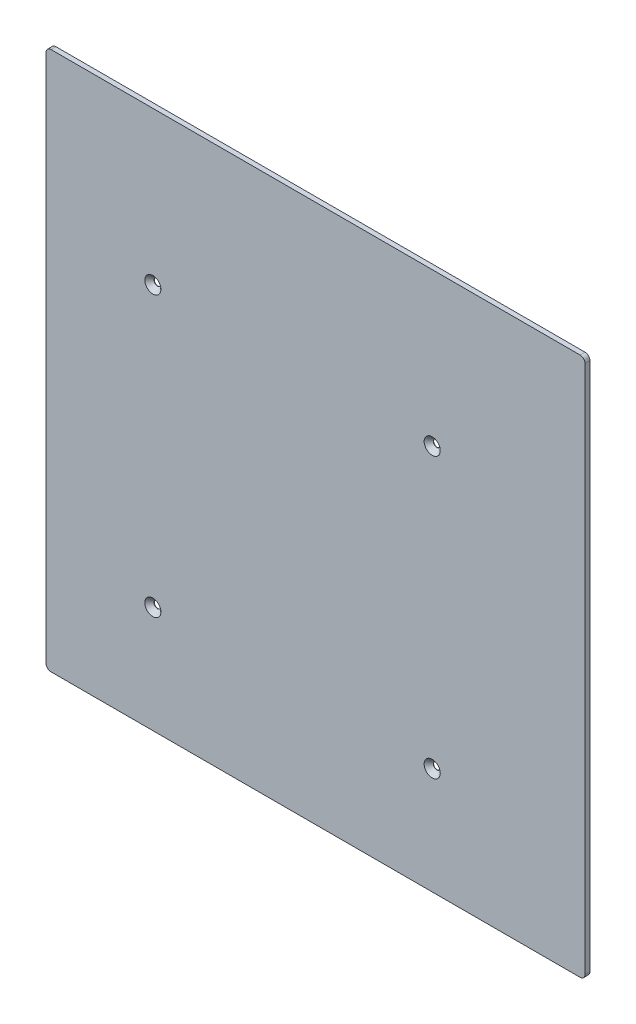
ISO-10303-21;
HEADER;
FILE_DESCRIPTION(('STEP AP214'),'2;1');
FILE_NAME('part.step','',(''),(''),'','','');
FILE_SCHEMA(('AUTOMOTIVE_DESIGN { 1 0 10303 214 1 1 1 1 }'));
ENDSEC;
DATA;
#1=APPLICATION_CONTEXT('core data for automotive mechanical design processes');
#2=APPLICATION_PROTOCOL_DEFINITION('international standard','automotive_design',2000,#1);
#3=PRODUCT_CONTEXT('',#1,'mechanical');
#4=PRODUCT('Part','Part','',(#3));
#5=PRODUCT_RELATED_PRODUCT_CATEGORY('part','',(#4));
#6=PRODUCT_DEFINITION_FORMATION('','',#4);
#7=PRODUCT_DEFINITION_CONTEXT('part definition',#1,'design');
#8=PRODUCT_DEFINITION('design','',#6,#7);
#9=PRODUCT_DEFINITION_SHAPE('','',#8);
#10=(LENGTH_UNIT() NAMED_UNIT(*) SI_UNIT(.MILLI.,.METRE.));
#11=(NAMED_UNIT(*) PLANE_ANGLE_UNIT() SI_UNIT($,.RADIAN.));
#12=(NAMED_UNIT(*) SI_UNIT($,.STERADIAN.) SOLID_ANGLE_UNIT());
#13=UNCERTAINTY_MEASURE_WITH_UNIT(LENGTH_MEASURE(1.E-05),#10,'distance_accuracy_value','');
#14=(GEOMETRIC_REPRESENTATION_CONTEXT(3) GLOBAL_UNCERTAINTY_ASSIGNED_CONTEXT((#13)) GLOBAL_UNIT_ASSIGNED_CONTEXT((#10,
#11,#12)) REPRESENTATION_CONTEXT('',''));
#15=CARTESIAN_POINT('',(0.,0.,0.));
#16=DIRECTION('',(0.,0.,1.));
#17=DIRECTION('',(1.,0.,0.));
#18=AXIS2_PLACEMENT_3D('',#15,#16,#17);
#19=CARTESIAN_POINT('',(0.,0.,0.));
#20=DIRECTION('',(0.,0.,-1.));
#21=DIRECTION('',(-1.,0.,0.));
#22=AXIS2_PLACEMENT_3D('',#19,#20,#21);
#23=PLANE('',#22);
#24=CARTESIAN_POINT('',(-85.,-85.,0.));
#25=DIRECTION('',(0.,0.,1.));
#26=DIRECTION('',(1.,0.,0.));
#27=AXIS2_PLACEMENT_3D('',#24,#25,#26);
#28=CIRCLE('',#27,2.09999999994805);
#29=CARTESIAN_POINT('',(-82.9000000000519,-85.,0.));
#30=VERTEX_POINT('',#29);
#31=EDGE_CURVE('E492',#30,#30,#28,.T.);
#32=ORIENTED_EDGE('',*,*,#31,.T.);
#33=EDGE_LOOP('',(#32));
#34=FACE_BOUND('',#33,.T.);
#35=CARTESIAN_POINT('',(85.,-85.,0.));
#36=DIRECTION('',(0.,0.,1.));
#37=DIRECTION('',(1.,0.,0.));
#38=AXIS2_PLACEMENT_3D('',#35,#36,#37);
#39=CIRCLE('',#38,2.09999999994805);
#40=CARTESIAN_POINT('',(87.0999999999481,-85.,0.));
#41=VERTEX_POINT('',#40);
#42=EDGE_CURVE('E485',#41,#41,#39,.T.);
#43=ORIENTED_EDGE('',*,*,#42,.T.);
#44=EDGE_LOOP('',(#43));
#45=FACE_BOUND('',#44,.T.);
#46=CARTESIAN_POINT('',(85.,85.,0.));
#47=DIRECTION('',(0.,0.,1.));
#48=DIRECTION('',(1.,0.,0.));
#49=AXIS2_PLACEMENT_3D('',#46,#47,#48);
#50=CIRCLE('',#49,2.09999999994805);
#51=CARTESIAN_POINT('',(87.0999999999481,85.,0.));
#52=VERTEX_POINT('',#51);
#53=EDGE_CURVE('E475',#52,#52,#50,.T.);
#54=ORIENTED_EDGE('',*,*,#53,.T.);
#55=EDGE_LOOP('',(#54));
#56=FACE_BOUND('',#55,.T.);
#57=DIRECTION('',(-1.,0.,0.));
#58=VECTOR('',#57,1.);
#59=CARTESIAN_POINT('',(178.,-150.,0.));
#60=LINE('',#59,#58);
#61=CARTESIAN_POINT('',(175.,-150.,0.));
#62=VERTEX_POINT('',#61);
#63=CARTESIAN_POINT('',(-147.,-150.,0.));
#64=VERTEX_POINT('',#63);
#65=EDGE_CURVE('E164',#62,#64,#60,.T.);
#66=ORIENTED_EDGE('',*,*,#65,.T.);
#67=CARTESIAN_POINT('',(-147.,-147.,0.));
#68=DIRECTION('',(0.,0.,-1.));
#69=DIRECTION('',(-1.,0.,0.));
#70=AXIS2_PLACEMENT_3D('',#67,#68,#69);
#71=CIRCLE('',#70,3.);
#72=CARTESIAN_POINT('',(-150.,-147.,0.));
#73=VERTEX_POINT('',#72);
#74=EDGE_CURVE('E201',#64,#73,#71,.T.);
#75=ORIENTED_EDGE('',*,*,#74,.T.);
#76=DIRECTION('',(0.,1.,0.));
#77=VECTOR('',#76,1.);
#78=CARTESIAN_POINT('',(-150.,-150.,0.));
#79=LINE('',#78,#77);
#80=CARTESIAN_POINT('',(-150.,175.,0.));
#81=VERTEX_POINT('',#80);
#82=EDGE_CURVE('E183',#73,#81,#79,.T.);
#83=ORIENTED_EDGE('',*,*,#82,.T.);
#84=CARTESIAN_POINT('',(-147.,175.,0.));
#85=DIRECTION('',(0.,0.,-1.));
#86=DIRECTION('',(-1.,0.,0.));
#87=AXIS2_PLACEMENT_3D('',#84,#85,#86);
#88=CIRCLE('',#87,3.);
#89=CARTESIAN_POINT('',(-147.,178.,0.));
#90=VERTEX_POINT('',#89);
#91=EDGE_CURVE('E197',#81,#90,#88,.T.);
#92=ORIENTED_EDGE('',*,*,#91,.T.);
#93=DIRECTION('',(1.,0.,0.));
#94=VECTOR('',#93,1.);
#95=CARTESIAN_POINT('',(-150.,178.,0.));
#96=LINE('',#95,#94);
#97=CARTESIAN_POINT('',(175.,178.,0.));
#98=VERTEX_POINT('',#97);
#99=EDGE_CURVE('E186',#90,#98,#96,.T.);
#100=ORIENTED_EDGE('',*,*,#99,.T.);
#101=CARTESIAN_POINT('',(175.,175.,0.));
#102=DIRECTION('',(0.,0.,-1.));
#103=DIRECTION('',(-1.,0.,0.));
#104=AXIS2_PLACEMENT_3D('',#101,#102,#103);
#105=CIRCLE('',#104,3.);
#106=CARTESIAN_POINT('',(178.,175.,0.));
#107=VERTEX_POINT('',#106);
#108=EDGE_CURVE('E195',#98,#107,#105,.T.);
#109=ORIENTED_EDGE('',*,*,#108,.T.);
#110=DIRECTION('',(0.,-1.,0.));
#111=VECTOR('',#110,1.);
#112=CARTESIAN_POINT('',(178.,178.,0.));
#113=LINE('',#112,#111);
#114=CARTESIAN_POINT('',(178.,-147.,0.));
#115=VERTEX_POINT('',#114);
#116=EDGE_CURVE('E172',#107,#115,#113,.T.);
#117=ORIENTED_EDGE('',*,*,#116,.T.);
#118=CARTESIAN_POINT('',(175.,-147.,0.));
#119=DIRECTION('',(0.,0.,-1.));
#120=DIRECTION('',(-1.,0.,0.));
#121=AXIS2_PLACEMENT_3D('',#118,#119,#120);
#122=CIRCLE('',#121,3.);
#123=EDGE_CURVE('E199',#115,#62,#122,.T.);
#124=ORIENTED_EDGE('',*,*,#123,.T.);
#125=EDGE_LOOP('',(#66,#75,#83,#92,#100,#109,#117,#124));
#126=FACE_BOUND('',#125,.T.);
#127=DIRECTION('',(1.,0.,0.));
#128=VECTOR('',#127,1.);
#129=CARTESIAN_POINT('',(-101.46292574176,117.5,0.));
#130=LINE('',#129,#128);
#131=CARTESIAN_POINT('',(-101.46292574176,117.5,0.));
#132=VERTEX_POINT('',#131);
#133=CARTESIAN_POINT('',(-72.6507614869108,117.5,0.));
#134=VERTEX_POINT('',#133);
#135=EDGE_CURVE('E129',#132,#134,#130,.T.);
#136=ORIENTED_EDGE('',*,*,#135,.F.);
#137=DIRECTION('',(0.,1.,0.));
#138=VECTOR('',#137,1.);
#139=CARTESIAN_POINT('',(-101.46292574176,106.050790199477,0.));
#140=LINE('',#139,#138);
#141=CARTESIAN_POINT('',(-101.46292574176,106.050790199477,0.));
#142=VERTEX_POINT('',#141);
#143=EDGE_CURVE('E146',#142,#132,#140,.T.);
#144=ORIENTED_EDGE('',*,*,#143,.F.);
#145=DIRECTION('',(-1.,0.,0.));
#146=VECTOR('',#145,1.);
#147=CARTESIAN_POINT('',(-72.6507614869108,106.050790199477,0.));
#148=LINE('',#147,#146);
#149=CARTESIAN_POINT('',(-72.6507614869108,106.050790199477,0.));
#150=VERTEX_POINT('',#149);
#151=EDGE_CURVE('E149',#150,#142,#148,.T.);
#152=ORIENTED_EDGE('',*,*,#151,.F.);
#153=DIRECTION('',(0.,-1.,0.));
#154=VECTOR('',#153,1.);
#155=CARTESIAN_POINT('',(-72.6507614869108,117.5,0.));
#156=LINE('',#155,#154);
#157=EDGE_CURVE('E158',#134,#150,#156,.T.);
#158=ORIENTED_EDGE('',*,*,#157,.F.);
#159=EDGE_LOOP('',(#136,#144,#152,#158));
#160=FACE_BOUND('',#159,.T.);
#161=CARTESIAN_POINT('',(-85.,85.,0.));
#162=DIRECTION('',(0.,0.,1.));
#163=DIRECTION('',(1.,0.,0.));
#164=AXIS2_PLACEMENT_3D('',#161,#162,#163);
#165=CIRCLE('',#164,2.09999999994805);
#166=CARTESIAN_POINT('',(-82.9000000000519,85.,0.));
#167=VERTEX_POINT('',#166);
#168=EDGE_CURVE('E152',#167,#167,#165,.T.);
#169=ORIENTED_EDGE('',*,*,#168,.T.);
#170=EDGE_LOOP('',(#169));
#171=FACE_BOUND('',#170,.T.);
#172=ADVANCED_FACE('F33',(#34,#45,#56,#126,#160,#171),#23,.T.);
#173=CARTESIAN_POINT('',(178.,-150.,3.));
#174=DIRECTION('',(0.,-1.,0.));
#175=DIRECTION('',(0.,0.,-1.));
#176=AXIS2_PLACEMENT_3D('',#173,#174,#175);
#177=PLANE('',#176);
#178=DIRECTION('',(-1.,0.,0.));
#179=VECTOR('',#178,1.);
#180=CARTESIAN_POINT('',(178.,-150.,3.));
#181=LINE('',#180,#179);
#182=CARTESIAN_POINT('',(175.,-150.,3.));
#183=VERTEX_POINT('',#182);
#184=CARTESIAN_POINT('',(-147.,-150.,3.));
#185=VERTEX_POINT('',#184);
#186=EDGE_CURVE('E168',#183,#185,#181,.T.);
#187=ORIENTED_EDGE('',*,*,#186,.T.);
#188=DIRECTION('',(0.,0.,-1.));
#189=VECTOR('',#188,1.);
#190=CARTESIAN_POINT('',(-147.,-150.,3.));
#191=LINE('',#190,#189);
#192=EDGE_CURVE('E192',#185,#64,#191,.T.);
#193=ORIENTED_EDGE('',*,*,#192,.T.);
#194=ORIENTED_EDGE('',*,*,#65,.F.);
#195=DIRECTION('',(0.,0.,-1.));
#196=VECTOR('',#195,1.);
#197=CARTESIAN_POINT('',(175.,-150.,3.));
#198=LINE('',#197,#196);
#199=EDGE_CURVE('E180',#62,#183,#198,.F.);
#200=ORIENTED_EDGE('',*,*,#199,.T.);
#201=EDGE_LOOP('',(#187,#193,#194,#200));
#202=FACE_BOUND('',#201,.T.);
#203=ADVANCED_FACE('F243',(#202),#177,.T.);
#204=CARTESIAN_POINT('',(178.,178.,3.));
#205=DIRECTION('',(1.,0.,0.));
#206=DIRECTION('',(0.,0.,-1.));
#207=AXIS2_PLACEMENT_3D('',#204,#205,#206);
#208=PLANE('',#207);
#209=DIRECTION('',(0.,-1.,0.));
#210=VECTOR('',#209,1.);
#211=CARTESIAN_POINT('',(178.,178.,3.));
#212=LINE('',#211,#210);
#213=CARTESIAN_POINT('',(178.,175.,3.));
#214=VERTEX_POINT('',#213);
#215=CARTESIAN_POINT('',(178.,-147.,3.));
#216=VERTEX_POINT('',#215);
#217=EDGE_CURVE('E177',#214,#216,#212,.T.);
#218=ORIENTED_EDGE('',*,*,#217,.T.);
#219=DIRECTION('',(0.,0.,-1.));
#220=VECTOR('',#219,1.);
#221=CARTESIAN_POINT('',(178.,-147.,3.));
#222=LINE('',#221,#220);
#223=EDGE_CURVE('E217',#216,#115,#222,.T.);
#224=ORIENTED_EDGE('',*,*,#223,.T.);
#225=ORIENTED_EDGE('',*,*,#116,.F.);
#226=DIRECTION('',(0.,0.,-1.));
#227=VECTOR('',#226,1.);
#228=CARTESIAN_POINT('',(178.,175.,3.));
#229=LINE('',#228,#227);
#230=EDGE_CURVE('E215',#107,#214,#229,.F.);
#231=ORIENTED_EDGE('',*,*,#230,.T.);
#232=EDGE_LOOP('',(#218,#224,#225,#231));
#233=FACE_BOUND('',#232,.T.);
#234=ADVANCED_FACE('F250',(#233),#208,.T.);
#235=CARTESIAN_POINT('',(-150.,178.,3.));
#236=DIRECTION('',(0.,1.,0.));
#237=DIRECTION('',(-1.,0.,0.));
#238=AXIS2_PLACEMENT_3D('',#235,#236,#237);
#239=PLANE('',#238);
#240=ORIENTED_EDGE('',*,*,#99,.F.);
#241=DIRECTION('',(0.,0.,-1.));
#242=VECTOR('',#241,1.);
#243=CARTESIAN_POINT('',(-147.,178.,3.));
#244=LINE('',#243,#242);
#245=CARTESIAN_POINT('',(-147.,178.,3.));
#246=VERTEX_POINT('',#245);
#247=EDGE_CURVE('E11',#90,#246,#244,.F.);
#248=ORIENTED_EDGE('',*,*,#247,.T.);
#249=DIRECTION('',(1.,0.,0.));
#250=VECTOR('',#249,1.);
#251=CARTESIAN_POINT('',(-150.,178.,3.));
#252=LINE('',#251,#250);
#253=CARTESIAN_POINT('',(175.,178.,3.));
#254=VERTEX_POINT('',#253);
#255=EDGE_CURVE('E175',#246,#254,#252,.T.);
#256=ORIENTED_EDGE('',*,*,#255,.T.);
#257=DIRECTION('',(0.,0.,-1.));
#258=VECTOR('',#257,1.);
#259=CARTESIAN_POINT('',(175.,178.,3.));
#260=LINE('',#259,#258);
#261=EDGE_CURVE('E41',#254,#98,#260,.T.);
#262=ORIENTED_EDGE('',*,*,#261,.T.);
#263=EDGE_LOOP('',(#240,#248,#256,#262));
#264=FACE_BOUND('',#263,.T.);
#265=ADVANCED_FACE('F221',(#264),#239,.T.);
#266=CARTESIAN_POINT('',(-150.,-150.,3.));
#267=DIRECTION('',(-1.,0.,0.));
#268=DIRECTION('',(0.,0.,1.));
#269=AXIS2_PLACEMENT_3D('',#266,#267,#268);
#270=PLANE('',#269);
#271=ORIENTED_EDGE('',*,*,#82,.F.);
#272=DIRECTION('',(0.,0.,-1.));
#273=VECTOR('',#272,1.);
#274=CARTESIAN_POINT('',(-150.,-147.,3.));
#275=LINE('',#274,#273);
#276=CARTESIAN_POINT('',(-150.,-147.,3.));
#277=VERTEX_POINT('',#276);
#278=EDGE_CURVE('E206',#73,#277,#275,.F.);
#279=ORIENTED_EDGE('',*,*,#278,.T.);
#280=DIRECTION('',(0.,1.,0.));
#281=VECTOR('',#280,1.);
#282=CARTESIAN_POINT('',(-150.,-150.,3.));
#283=LINE('',#282,#281);
#284=CARTESIAN_POINT('',(-150.,175.,3.));
#285=VERTEX_POINT('',#284);
#286=EDGE_CURVE('E171',#277,#285,#283,.T.);
#287=ORIENTED_EDGE('',*,*,#286,.T.);
#288=DIRECTION('',(0.,0.,-1.));
#289=VECTOR('',#288,1.);
#290=CARTESIAN_POINT('',(-150.,175.,3.));
#291=LINE('',#290,#289);
#292=EDGE_CURVE('E203',#285,#81,#291,.T.);
#293=ORIENTED_EDGE('',*,*,#292,.T.);
#294=EDGE_LOOP('',(#271,#279,#287,#293));
#295=FACE_BOUND('',#294,.T.);
#296=ADVANCED_FACE('F232',(#295),#270,.T.);
#297=CARTESIAN_POINT('',(0.,0.,3.));
#298=DIRECTION('',(0.,0.,-1.));
#299=DIRECTION('',(-1.,0.,0.));
#300=AXIS2_PLACEMENT_3D('',#297,#298,#299);
#301=PLANE('',#300);
#302=CARTESIAN_POINT('',(-85.,-85.,3.));
#303=DIRECTION('',(0.,0.,1.));
#304=DIRECTION('',(1.,0.,0.));
#305=AXIS2_PLACEMENT_3D('',#302,#303,#304);
#306=CIRCLE('',#305,4.90000000002055);
#307=CARTESIAN_POINT('',(-80.0999999999794,-85.,3.));
#308=VERTEX_POINT('',#307);
#309=EDGE_CURVE('E461',#308,#308,#306,.T.);
#310=ORIENTED_EDGE('',*,*,#309,.F.);
#311=EDGE_LOOP('',(#310));
#312=FACE_BOUND('',#311,.T.);
#313=CARTESIAN_POINT('',(85.,-85.,3.));
#314=DIRECTION('',(0.,0.,1.));
#315=DIRECTION('',(1.,0.,0.));
#316=AXIS2_PLACEMENT_3D('',#313,#314,#315);
#317=CIRCLE('',#316,4.90000000002055);
#318=CARTESIAN_POINT('',(89.9000000000206,-85.,3.));
#319=VERTEX_POINT('',#318);
#320=EDGE_CURVE('E465',#319,#319,#317,.T.);
#321=ORIENTED_EDGE('',*,*,#320,.F.);
#322=EDGE_LOOP('',(#321));
#323=FACE_BOUND('',#322,.T.);
#324=CARTESIAN_POINT('',(85.,85.,3.));
#325=DIRECTION('',(0.,0.,1.));
#326=DIRECTION('',(1.,0.,0.));
#327=AXIS2_PLACEMENT_3D('',#324,#325,#326);
#328=CIRCLE('',#327,4.90000000002055);
#329=CARTESIAN_POINT('',(89.9000000000206,85.,3.));
#330=VERTEX_POINT('',#329);
#331=EDGE_CURVE('E469',#330,#330,#328,.T.);
#332=ORIENTED_EDGE('',*,*,#331,.F.);
#333=EDGE_LOOP('',(#332));
#334=FACE_BOUND('',#333,.T.);
#335=CARTESIAN_POINT('',(-85.,85.,3.));
#336=DIRECTION('',(0.,0.,1.));
#337=DIRECTION('',(1.,0.,0.));
#338=AXIS2_PLACEMENT_3D('',#335,#336,#337);
#339=CIRCLE('',#338,4.90000000002055);
#340=CARTESIAN_POINT('',(-80.0999999999794,85.,3.));
#341=VERTEX_POINT('',#340);
#342=EDGE_CURVE('E472',#341,#341,#339,.T.);
#343=ORIENTED_EDGE('',*,*,#342,.F.);
#344=EDGE_LOOP('',(#343));
#345=FACE_BOUND('',#344,.T.);
#346=ORIENTED_EDGE('',*,*,#286,.F.);
#347=CARTESIAN_POINT('',(-147.,-147.,3.));
#348=DIRECTION('',(0.,0.,-1.));
#349=DIRECTION('',(-1.,0.,0.));
#350=AXIS2_PLACEMENT_3D('',#347,#348,#349);
#351=CIRCLE('',#350,3.);
#352=EDGE_CURVE('E213',#277,#185,#351,.F.);
#353=ORIENTED_EDGE('',*,*,#352,.T.);
#354=ORIENTED_EDGE('',*,*,#186,.F.);
#355=CARTESIAN_POINT('',(175.,-147.,3.));
#356=DIRECTION('',(0.,0.,-1.));
#357=DIRECTION('',(-1.,0.,0.));
#358=AXIS2_PLACEMENT_3D('',#355,#356,#357);
#359=CIRCLE('',#358,3.);
#360=EDGE_CURVE('E211',#183,#216,#359,.F.);
#361=ORIENTED_EDGE('',*,*,#360,.T.);
#362=ORIENTED_EDGE('',*,*,#217,.F.);
#363=CARTESIAN_POINT('',(175.,175.,3.));
#364=DIRECTION('',(0.,0.,-1.));
#365=DIRECTION('',(-1.,0.,0.));
#366=AXIS2_PLACEMENT_3D('',#363,#364,#365);
#367=CIRCLE('',#366,3.);
#368=EDGE_CURVE('E48',#214,#254,#367,.F.);
#369=ORIENTED_EDGE('',*,*,#368,.T.);
#370=ORIENTED_EDGE('',*,*,#255,.F.);
#371=CARTESIAN_POINT('',(-147.,175.,3.));
#372=DIRECTION('',(0.,0.,-1.));
#373=DIRECTION('',(-1.,0.,0.));
#374=AXIS2_PLACEMENT_3D('',#371,#372,#373);
#375=CIRCLE('',#374,3.);
#376=EDGE_CURVE('E209',#246,#285,#375,.F.);
#377=ORIENTED_EDGE('',*,*,#376,.T.);
#378=EDGE_LOOP('',(#346,#353,#354,#361,#362,#369,#370,#377));
#379=FACE_BOUND('',#378,.T.);
#380=ADVANCED_FACE('F236',(#312,#323,#334,#345,#379),#301,.F.);
#381=CARTESIAN_POINT('',(-101.46292574176,117.5,0.5));
#382=DIRECTION('',(0.,1.,0.));
#383=DIRECTION('',(0.,0.,1.));
#384=AXIS2_PLACEMENT_3D('',#381,#382,#383);
#385=PLANE('',#384);
#386=ORIENTED_EDGE('',*,*,#135,.T.);
#387=DIRECTION('',(0.,0.,-1.));
#388=VECTOR('',#387,1.);
#389=CARTESIAN_POINT('',(-72.6507614869108,117.5,0.5));
#390=LINE('',#389,#388);
#391=CARTESIAN_POINT('',(-72.6507614869108,117.5,0.5));
#392=VERTEX_POINT('',#391);
#393=EDGE_CURVE('E122',#392,#134,#390,.T.);
#394=ORIENTED_EDGE('',*,*,#393,.F.);
#395=DIRECTION('',(1.,0.,0.));
#396=VECTOR('',#395,1.);
#397=CARTESIAN_POINT('',(-101.46292574176,117.5,0.5));
#398=LINE('',#397,#396);
#399=CARTESIAN_POINT('',(-101.46292574176,117.5,0.5));
#400=VERTEX_POINT('',#399);
#401=EDGE_CURVE('E126',#400,#392,#398,.T.);
#402=ORIENTED_EDGE('',*,*,#401,.F.);
#403=DIRECTION('',(0.,0.,-1.));
#404=VECTOR('',#403,1.);
#405=CARTESIAN_POINT('',(-101.46292574176,117.5,0.5));
#406=LINE('',#405,#404);
#407=EDGE_CURVE('E162',#400,#132,#406,.T.);
#408=ORIENTED_EDGE('',*,*,#407,.T.);
#409=EDGE_LOOP('',(#386,#394,#402,#408));
#410=FACE_BOUND('',#409,.T.);
#411=ADVANCED_FACE('F124',(#410),#385,.F.);
#412=CARTESIAN_POINT('',(-101.46292574176,106.050790199477,0.5));
#413=DIRECTION('',(-1.,0.,0.));
#414=DIRECTION('',(0.,0.,1.));
#415=AXIS2_PLACEMENT_3D('',#412,#413,#414);
#416=PLANE('',#415);
#417=ORIENTED_EDGE('',*,*,#143,.T.);
#418=ORIENTED_EDGE('',*,*,#407,.F.);
#419=DIRECTION('',(0.,1.,0.));
#420=VECTOR('',#419,1.);
#421=CARTESIAN_POINT('',(-101.46292574176,106.050790199477,0.5));
#422=LINE('',#421,#420);
#423=CARTESIAN_POINT('',(-101.46292574176,106.050790199477,0.5));
#424=VERTEX_POINT('',#423);
#425=EDGE_CURVE('E134',#424,#400,#422,.T.);
#426=ORIENTED_EDGE('',*,*,#425,.F.);
#427=DIRECTION('',(0.,0.,-1.));
#428=VECTOR('',#427,1.);
#429=CARTESIAN_POINT('',(-101.46292574176,106.050790199477,0.5));
#430=LINE('',#429,#428);
#431=EDGE_CURVE('E165',#424,#142,#430,.T.);
#432=ORIENTED_EDGE('',*,*,#431,.T.);
#433=EDGE_LOOP('',(#417,#418,#426,#432));
#434=FACE_BOUND('',#433,.T.);
#435=ADVANCED_FACE('F398',(#434),#416,.F.);
#436=CARTESIAN_POINT('',(-72.6507614869108,106.050790199477,0.5));
#437=DIRECTION('',(0.,-1.,0.));
#438=DIRECTION('',(0.,0.,-1.));
#439=AXIS2_PLACEMENT_3D('',#436,#437,#438);
#440=PLANE('',#439);
#441=ORIENTED_EDGE('',*,*,#151,.T.);
#442=ORIENTED_EDGE('',*,*,#431,.F.);
#443=DIRECTION('',(-1.,0.,0.));
#444=VECTOR('',#443,1.);
#445=CARTESIAN_POINT('',(-72.6507614869108,106.050790199477,0.5));
#446=LINE('',#445,#444);
#447=CARTESIAN_POINT('',(-72.6507614869108,106.050790199477,0.5));
#448=VERTEX_POINT('',#447);
#449=EDGE_CURVE('E142',#448,#424,#446,.T.);
#450=ORIENTED_EDGE('',*,*,#449,.F.);
#451=DIRECTION('',(0.,0.,-1.));
#452=VECTOR('',#451,1.);
#453=CARTESIAN_POINT('',(-72.6507614869108,106.050790199477,0.5));
#454=LINE('',#453,#452);
#455=EDGE_CURVE('E133',#448,#150,#454,.T.);
#456=ORIENTED_EDGE('',*,*,#455,.T.);
#457=EDGE_LOOP('',(#441,#442,#450,#456));
#458=FACE_BOUND('',#457,.T.);
#459=ADVANCED_FACE('F390',(#458),#440,.F.);
#460=CARTESIAN_POINT('',(-72.6507614869108,117.5,0.5));
#461=DIRECTION('',(1.,0.,0.));
#462=DIRECTION('',(0.,0.,-1.));
#463=AXIS2_PLACEMENT_3D('',#460,#461,#462);
#464=PLANE('',#463);
#465=ORIENTED_EDGE('',*,*,#157,.T.);
#466=ORIENTED_EDGE('',*,*,#455,.F.);
#467=DIRECTION('',(0.,-1.,0.));
#468=VECTOR('',#467,1.);
#469=CARTESIAN_POINT('',(-72.6507614869108,117.5,0.5));
#470=LINE('',#469,#468);
#471=EDGE_CURVE('E137',#392,#448,#470,.T.);
#472=ORIENTED_EDGE('',*,*,#471,.F.);
#473=ORIENTED_EDGE('',*,*,#393,.T.);
#474=EDGE_LOOP('',(#465,#466,#472,#473));
#475=FACE_BOUND('',#474,.T.);
#476=ADVANCED_FACE('F138',(#475),#464,.F.);
#477=CARTESIAN_POINT('',(0.,0.,0.5));
#478=DIRECTION('',(0.,0.,-1.));
#479=DIRECTION('',(-1.,0.,0.));
#480=AXIS2_PLACEMENT_3D('',#477,#478,#479);
#481=PLANE('',#480);
#482=ORIENTED_EDGE('',*,*,#401,.T.);
#483=ORIENTED_EDGE('',*,*,#471,.T.);
#484=ORIENTED_EDGE('',*,*,#449,.T.);
#485=ORIENTED_EDGE('',*,*,#425,.T.);
#486=EDGE_LOOP('',(#482,#483,#484,#485));
#487=FACE_BOUND('',#486,.T.);
#488=ADVANCED_FACE('F144',(#487),#481,.T.);
#489=CARTESIAN_POINT('',(-85.,85.,3.));
#490=DIRECTION('',(0.,0.,1.));
#491=DIRECTION('',(1.,0.,0.));
#492=AXIS2_PLACEMENT_3D('',#489,#490,#491);
#493=CYLINDRICAL_SURFACE('',#492,2.09999999994805);
#494=ORIENTED_EDGE('',*,*,#168,.F.);
#495=EDGE_LOOP('',(#494));
#496=FACE_BOUND('',#495,.T.);
#497=CARTESIAN_POINT('',(-85.,85.,0.199999999984335));
#498=DIRECTION('',(0.,0.,1.));
#499=DIRECTION('',(1.,0.,0.));
#500=AXIS2_PLACEMENT_3D('',#497,#498,#499);
#501=CIRCLE('',#500,2.09999999994805);
#502=CARTESIAN_POINT('',(-82.9000000000519,85.,0.199999999984335));
#503=VERTEX_POINT('',#502);
#504=EDGE_CURVE('E474',#503,#503,#501,.T.);
#505=ORIENTED_EDGE('',*,*,#504,.T.);
#506=EDGE_LOOP('',(#505));
#507=FACE_BOUND('',#506,.T.);
#508=ADVANCED_FACE('F361',(#496,#507),#493,.F.);
#509=CARTESIAN_POINT('',(-85.,85.,3.));
#510=DIRECTION('',(0.,0.,1.));
#511=DIRECTION('',(1.,0.,0.));
#512=AXIS2_PLACEMENT_3D('',#509,#510,#511);
#513=CONICAL_SURFACE('',#512,4.90000000002055,0.785398163407599);
#514=ORIENTED_EDGE('',*,*,#504,.F.);
#515=EDGE_LOOP('',(#514));
#516=FACE_BOUND('',#515,.T.);
#517=ORIENTED_EDGE('',*,*,#342,.T.);
#518=EDGE_LOOP('',(#517));
#519=FACE_BOUND('',#518,.T.);
#520=ADVANCED_FACE('F352',(#516,#519),#513,.F.);
#521=CARTESIAN_POINT('',(85.,85.,3.));
#522=DIRECTION('',(0.,0.,1.));
#523=DIRECTION('',(1.,0.,0.));
#524=AXIS2_PLACEMENT_3D('',#521,#522,#523);
#525=CYLINDRICAL_SURFACE('',#524,2.09999999994805);
#526=ORIENTED_EDGE('',*,*,#53,.F.);
#527=EDGE_LOOP('',(#526));
#528=FACE_BOUND('',#527,.T.);
#529=CARTESIAN_POINT('',(85.,85.,0.199999999984335));
#530=DIRECTION('',(0.,0.,1.));
#531=DIRECTION('',(1.,0.,0.));
#532=AXIS2_PLACEMENT_3D('',#529,#530,#531);
#533=CIRCLE('',#532,2.09999999994805);
#534=CARTESIAN_POINT('',(87.0999999999481,85.,0.199999999984335));
#535=VERTEX_POINT('',#534);
#536=EDGE_CURVE('E479',#535,#535,#533,.T.);
#537=ORIENTED_EDGE('',*,*,#536,.T.);
#538=EDGE_LOOP('',(#537));
#539=FACE_BOUND('',#538,.T.);
#540=ADVANCED_FACE('F343',(#528,#539),#525,.F.);
#541=CARTESIAN_POINT('',(85.,85.,3.));
#542=DIRECTION('',(0.,0.,1.));
#543=DIRECTION('',(1.,0.,0.));
#544=AXIS2_PLACEMENT_3D('',#541,#542,#543);
#545=CONICAL_SURFACE('',#544,4.90000000002055,0.785398163407599);
#546=ORIENTED_EDGE('',*,*,#536,.F.);
#547=EDGE_LOOP('',(#546));
#548=FACE_BOUND('',#547,.T.);
#549=ORIENTED_EDGE('',*,*,#331,.T.);
#550=EDGE_LOOP('',(#549));
#551=FACE_BOUND('',#550,.T.);
#552=ADVANCED_FACE('F334',(#548,#551),#545,.F.);
#553=CARTESIAN_POINT('',(85.,-85.,3.));
#554=DIRECTION('',(0.,0.,1.));
#555=DIRECTION('',(1.,0.,0.));
#556=AXIS2_PLACEMENT_3D('',#553,#554,#555);
#557=CYLINDRICAL_SURFACE('',#556,2.09999999994805);
#558=ORIENTED_EDGE('',*,*,#42,.F.);
#559=EDGE_LOOP('',(#558));
#560=FACE_BOUND('',#559,.T.);
#561=CARTESIAN_POINT('',(85.,-85.,0.199999999984335));
#562=DIRECTION('',(0.,0.,1.));
#563=DIRECTION('',(1.,0.,0.));
#564=AXIS2_PLACEMENT_3D('',#561,#562,#563);
#565=CIRCLE('',#564,2.09999999994805);
#566=CARTESIAN_POINT('',(87.0999999999481,-85.,0.199999999984335));
#567=VERTEX_POINT('',#566);
#568=EDGE_CURVE('E488',#567,#567,#565,.T.);
#569=ORIENTED_EDGE('',*,*,#568,.T.);
#570=EDGE_LOOP('',(#569));
#571=FACE_BOUND('',#570,.T.);
#572=ADVANCED_FACE('F325',(#560,#571),#557,.F.);
#573=CARTESIAN_POINT('',(85.,-85.,3.));
#574=DIRECTION('',(0.,0.,1.));
#575=DIRECTION('',(1.,0.,0.));
#576=AXIS2_PLACEMENT_3D('',#573,#574,#575);
#577=CONICAL_SURFACE('',#576,4.90000000002055,0.785398163407599);
#578=ORIENTED_EDGE('',*,*,#568,.F.);
#579=EDGE_LOOP('',(#578));
#580=FACE_BOUND('',#579,.T.);
#581=ORIENTED_EDGE('',*,*,#320,.T.);
#582=EDGE_LOOP('',(#581));
#583=FACE_BOUND('',#582,.T.);
#584=ADVANCED_FACE('F316',(#580,#583),#577,.F.);
#585=CARTESIAN_POINT('',(-85.,-85.,3.));
#586=DIRECTION('',(0.,0.,1.));
#587=DIRECTION('',(1.,0.,0.));
#588=AXIS2_PLACEMENT_3D('',#585,#586,#587);
#589=CYLINDRICAL_SURFACE('',#588,2.09999999994805);
#590=ORIENTED_EDGE('',*,*,#31,.F.);
#591=EDGE_LOOP('',(#590));
#592=FACE_BOUND('',#591,.T.);
#593=CARTESIAN_POINT('',(-85.,-85.,0.199999999984335));
#594=DIRECTION('',(0.,0.,1.));
#595=DIRECTION('',(1.,0.,0.));
#596=AXIS2_PLACEMENT_3D('',#593,#594,#595);
#597=CIRCLE('',#596,2.09999999994805);
#598=CARTESIAN_POINT('',(-82.9000000000519,-85.,0.199999999984335));
#599=VERTEX_POINT('',#598);
#600=EDGE_CURVE('E494',#599,#599,#597,.T.);
#601=ORIENTED_EDGE('',*,*,#600,.T.);
#602=EDGE_LOOP('',(#601));
#603=FACE_BOUND('',#602,.T.);
#604=ADVANCED_FACE('F307',(#592,#603),#589,.F.);
#605=CARTESIAN_POINT('',(-85.,-85.,3.));
#606=DIRECTION('',(0.,0.,1.));
#607=DIRECTION('',(1.,0.,0.));
#608=AXIS2_PLACEMENT_3D('',#605,#606,#607);
#609=CONICAL_SURFACE('',#608,4.90000000002055,0.785398163407599);
#610=ORIENTED_EDGE('',*,*,#600,.F.);
#611=EDGE_LOOP('',(#610));
#612=FACE_BOUND('',#611,.T.);
#613=ORIENTED_EDGE('',*,*,#309,.T.);
#614=EDGE_LOOP('',(#613));
#615=FACE_BOUND('',#614,.T.);
#616=ADVANCED_FACE('F276',(#612,#615),#609,.F.);
#617=CARTESIAN_POINT('',(-147.,-147.,3.));
#618=DIRECTION('',(0.,0.,-1.));
#619=DIRECTION('',(-1.,0.,0.));
#620=AXIS2_PLACEMENT_3D('',#617,#618,#619);
#621=CYLINDRICAL_SURFACE('',#620,3.);
#622=ORIENTED_EDGE('',*,*,#352,.F.);
#623=ORIENTED_EDGE('',*,*,#278,.F.);
#624=ORIENTED_EDGE('',*,*,#74,.F.);
#625=ORIENTED_EDGE('',*,*,#192,.F.);
#626=EDGE_LOOP('',(#622,#623,#624,#625));
#627=FACE_BOUND('',#626,.T.);
#628=ADVANCED_FACE('F240',(#627),#621,.T.);
#629=CARTESIAN_POINT('',(175.,-147.,3.));
#630=DIRECTION('',(0.,0.,-1.));
#631=DIRECTION('',(-1.,0.,0.));
#632=AXIS2_PLACEMENT_3D('',#629,#630,#631);
#633=CYLINDRICAL_SURFACE('',#632,3.);
#634=ORIENTED_EDGE('',*,*,#360,.F.);
#635=ORIENTED_EDGE('',*,*,#199,.F.);
#636=ORIENTED_EDGE('',*,*,#123,.F.);
#637=ORIENTED_EDGE('',*,*,#223,.F.);
#638=EDGE_LOOP('',(#634,#635,#636,#637));
#639=FACE_BOUND('',#638,.T.);
#640=ADVANCED_FACE('F248',(#639),#633,.T.);
#641=CARTESIAN_POINT('',(-147.,175.,3.));
#642=DIRECTION('',(0.,0.,-1.));
#643=DIRECTION('',(-1.,0.,0.));
#644=AXIS2_PLACEMENT_3D('',#641,#642,#643);
#645=CYLINDRICAL_SURFACE('',#644,3.);
#646=ORIENTED_EDGE('',*,*,#376,.F.);
#647=ORIENTED_EDGE('',*,*,#247,.F.);
#648=ORIENTED_EDGE('',*,*,#91,.F.);
#649=ORIENTED_EDGE('',*,*,#292,.F.);
#650=EDGE_LOOP('',(#646,#647,#648,#649));
#651=FACE_BOUND('',#650,.T.);
#652=ADVANCED_FACE('F230',(#651),#645,.T.);
#653=CARTESIAN_POINT('',(175.,175.,3.));
#654=DIRECTION('',(0.,0.,-1.));
#655=DIRECTION('',(-1.,0.,0.));
#656=AXIS2_PLACEMENT_3D('',#653,#654,#655);
#657=CYLINDRICAL_SURFACE('',#656,3.);
#658=ORIENTED_EDGE('',*,*,#368,.F.);
#659=ORIENTED_EDGE('',*,*,#230,.F.);
#660=ORIENTED_EDGE('',*,*,#108,.F.);
#661=ORIENTED_EDGE('',*,*,#261,.F.);
#662=EDGE_LOOP('',(#658,#659,#660,#661));
#663=FACE_BOUND('',#662,.T.);
#664=ADVANCED_FACE('F35',(#663),#657,.T.);
#665=CLOSED_SHELL('',(#172,#203,#234,#265,#296,#380,#411,#435,#459,#476,#488,#508,#520,#540,
#552,#572,#584,#604,#616,#628,#640,#652,#664));
#666=MANIFOLD_SOLID_BREP('B2',#665);
#667=ADVANCED_BREP_SHAPE_REPRESENTATION('',(#18,#666),#14);
#668=SHAPE_DEFINITION_REPRESENTATION(#9,#667);
ENDSEC;
END-ISO-10303-21;
